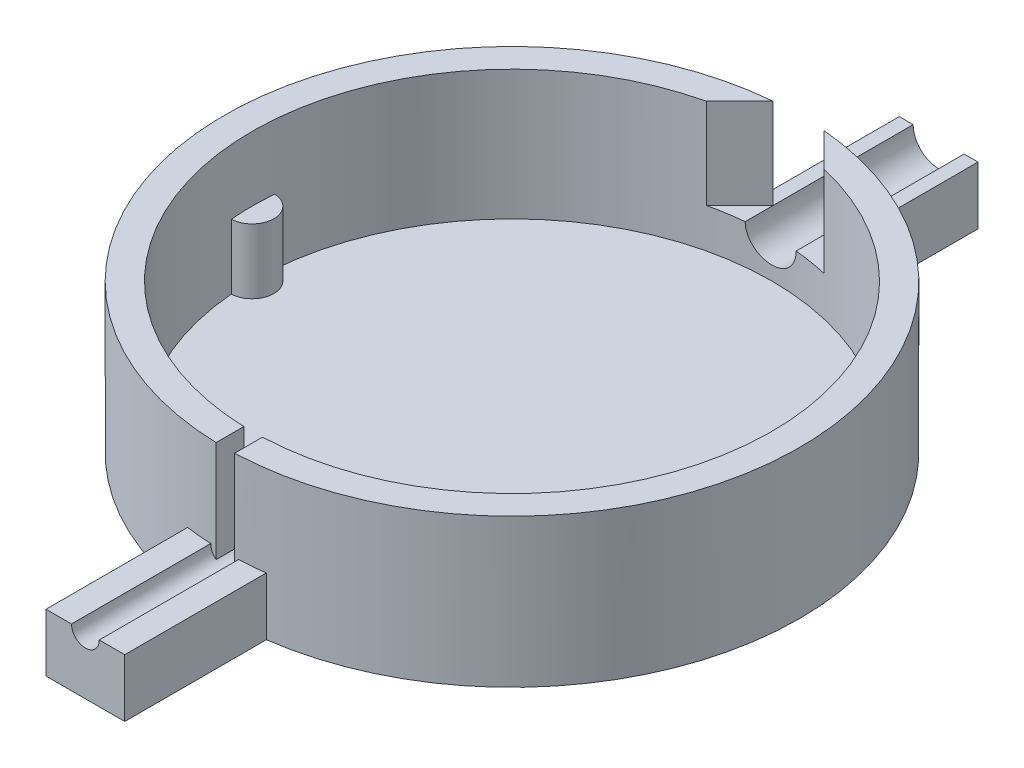
ISO-10303-21;
HEADER;
FILE_DESCRIPTION(('STEP AP214'),'2;1');
FILE_NAME('part.step','',(''),(''),'','','');
FILE_SCHEMA(('AUTOMOTIVE_DESIGN { 1 0 10303 214 1 1 1 1 }'));
ENDSEC;
DATA;
#1=APPLICATION_CONTEXT('core data for automotive mechanical design processes');
#2=APPLICATION_PROTOCOL_DEFINITION('international standard','automotive_design',2000,#1);
#3=PRODUCT_CONTEXT('',#1,'mechanical');
#4=PRODUCT('Part','Part','',(#3));
#5=PRODUCT_RELATED_PRODUCT_CATEGORY('part','',(#4));
#6=PRODUCT_DEFINITION_FORMATION('','',#4);
#7=PRODUCT_DEFINITION_CONTEXT('part definition',#1,'design');
#8=PRODUCT_DEFINITION('design','',#6,#7);
#9=PRODUCT_DEFINITION_SHAPE('','',#8);
#10=(LENGTH_UNIT() NAMED_UNIT(*) SI_UNIT(.MILLI.,.METRE.));
#11=(NAMED_UNIT(*) PLANE_ANGLE_UNIT() SI_UNIT($,.RADIAN.));
#12=(NAMED_UNIT(*) SI_UNIT($,.STERADIAN.) SOLID_ANGLE_UNIT());
#13=UNCERTAINTY_MEASURE_WITH_UNIT(LENGTH_MEASURE(1.E-05),#10,'distance_accuracy_value','');
#14=(GEOMETRIC_REPRESENTATION_CONTEXT(3) GLOBAL_UNCERTAINTY_ASSIGNED_CONTEXT((#13)) GLOBAL_UNIT_ASSIGNED_CONTEXT((#10,
#11,#12)) REPRESENTATION_CONTEXT('',''));
#15=CARTESIAN_POINT('',(0.,0.,0.));
#16=DIRECTION('',(0.,0.,1.));
#17=DIRECTION('',(1.,0.,0.));
#18=AXIS2_PLACEMENT_3D('',#15,#16,#17);
#19=CARTESIAN_POINT('',(0.,16.,0.));
#20=DIRECTION('',(0.,-1.,0.));
#21=DIRECTION('',(0.,0.,-1.));
#22=AXIS2_PLACEMENT_3D('',#19,#20,#21);
#23=CYLINDRICAL_SURFACE('',#22,31.06);
#24=CARTESIAN_POINT('',(0.,6.24999999999999,0.));
#25=DIRECTION('',(0.,1.,0.));
#26=DIRECTION('',(-1.,0.,0.));
#27=AXIS2_PLACEMENT_3D('',#24,#25,#26);
#28=CIRCLE('',#27,31.06);
#29=CARTESIAN_POINT('',(1.5,6.24999999999999,31.0237586375346));
#30=VERTEX_POINT('',#29);
#31=CARTESIAN_POINT('',(4.25,6.25,30.7678582290025));
#32=VERTEX_POINT('',#31);
#33=EDGE_CURVE('E12',#30,#32,#28,.T.);
#34=ORIENTED_EDGE('',*,*,#33,.T.);
#35=DIRECTION('',(0.,-1.,0.));
#36=VECTOR('',#35,1.);
#37=CARTESIAN_POINT('',(4.25,16.,30.7678582290025));
#38=LINE('',#37,#36);
#39=CARTESIAN_POINT('',(4.25,0.,30.7678582290025));
#40=VERTEX_POINT('',#39);
#41=EDGE_CURVE('E635',#32,#40,#38,.T.);
#42=ORIENTED_EDGE('',*,*,#41,.T.);
#43=CARTESIAN_POINT('',(0.,0.,0.));
#44=DIRECTION('',(0.,1.,0.));
#45=DIRECTION('',(0.,0.,1.));
#46=AXIS2_PLACEMENT_3D('',#43,#44,#45);
#47=CIRCLE('',#46,31.06);
#48=CARTESIAN_POINT('',(4.25,0.,-30.7678582290025));
#49=VERTEX_POINT('',#48);
#50=EDGE_CURVE('E268',#40,#49,#47,.T.);
#51=ORIENTED_EDGE('',*,*,#50,.T.);
#52=DIRECTION('',(0.,-1.,0.));
#53=VECTOR('',#52,1.);
#54=CARTESIAN_POINT('',(4.25,16.,-30.7678582290025));
#55=LINE('',#54,#53);
#56=CARTESIAN_POINT('',(4.25,6.25,-30.7678582290025));
#57=VERTEX_POINT('',#56);
#58=EDGE_CURVE('E634',#57,#49,#55,.T.);
#59=ORIENTED_EDGE('',*,*,#58,.F.);
#60=CARTESIAN_POINT('',(0.,6.25,0.));
#61=DIRECTION('',(0.,-1.,0.));
#62=DIRECTION('',(0.,0.,-1.));
#63=AXIS2_PLACEMENT_3D('',#60,#61,#62);
#64=CIRCLE('',#63,31.06);
#65=CARTESIAN_POINT('',(2.75,6.25,-30.9380202986552));
#66=VERTEX_POINT('',#65);
#67=EDGE_CURVE('E661',#66,#57,#64,.T.);
#68=ORIENTED_EDGE('',*,*,#67,.F.);
#69=DIRECTION('',(0.,-1.,0.));
#70=VECTOR('',#69,1.);
#71=CARTESIAN_POINT('',(2.75,16.,-30.9380202986552));
#72=LINE('',#71,#70);
#73=CARTESIAN_POINT('',(2.75,16.,-30.9380202986552));
#74=VERTEX_POINT('',#73);
#75=EDGE_CURVE('E688',#66,#74,#72,.F.);
#76=ORIENTED_EDGE('',*,*,#75,.T.);
#77=CARTESIAN_POINT('',(0.,16.,0.));
#78=DIRECTION('',(0.,1.,0.));
#79=DIRECTION('',(0.,0.,1.));
#80=AXIS2_PLACEMENT_3D('',#77,#78,#79);
#81=CIRCLE('',#80,31.06);
#82=CARTESIAN_POINT('',(1.09817667694527,16.,31.0405800201319));
#83=VERTEX_POINT('',#82);
#84=EDGE_CURVE('E264',#83,#74,#81,.T.);
#85=ORIENTED_EDGE('',*,*,#84,.F.);
#86=DIRECTION('',(0.,-1.,0.));
#87=VECTOR('',#86,1.);
#88=CARTESIAN_POINT('',(1.09817667694527,16.,31.0405800201319));
#89=LINE('',#88,#87);
#90=CARTESIAN_POINT('',(1.09817667694527,5.22823290999688,31.0405800201319));
#91=VERTEX_POINT('',#90);
#92=EDGE_CURVE('E675',#91,#83,#89,.F.);
#93=ORIENTED_EDGE('',*,*,#92,.F.);
#94=CARTESIAN_POINT('',(-1.5,6.25,31.0237586375346));
#95=CARTESIAN_POINT('',(-1.49999628253548,6.16579706835824,31.0237591246036));
#96=CARTESIAN_POINT('',(-1.49288605437479,6.08153433225865,31.0241051301728));
#97=CARTESIAN_POINT('',(-1.46462263785561,5.9153331174347,31.02545201881));
#98=CARTESIAN_POINT('',(-1.44345287943984,5.83339750032809,31.0264536745838));
#99=CARTESIAN_POINT('',(-1.3876777061799,5.67428218235709,31.0289981375779));
#100=CARTESIAN_POINT('',(-1.35307911151705,5.5971000903109,31.0305406700616));
#101=CARTESIAN_POINT('',(-1.2714387925071,5.44966015958785,31.0339927268488));
#102=CARTESIAN_POINT('',(-1.22440001582512,5.37940068602243,31.035902164186));
#103=CARTESIAN_POINT('',(-1.11916447798945,5.24771237996455,31.0398749590322));
#104=CARTESIAN_POINT('',(-1.06095845008783,5.18629095601391,31.041938443497));
#105=CARTESIAN_POINT('',(-0.93505906102969,5.07408539360754,31.0459856166731));
#106=CARTESIAN_POINT('',(-0.867365313799572,5.02330168823097,31.0479693021329));
#107=CARTESIAN_POINT('',(-0.724373962363878,4.93379326474336,31.0516342881519));
#108=CARTESIAN_POINT('',(-0.649072793394885,4.89507423505444,31.0533154459137));
#109=CARTESIAN_POINT('',(-0.493029238728981,4.83083078671933,31.0561846563226));
#110=CARTESIAN_POINT('',(-0.41228689218267,4.80530627314685,31.0573727125173));
#111=CARTESIAN_POINT('',(-0.247720372342416,4.76819574885948,31.0591209942328));
#112=CARTESIAN_POINT('',(-0.163898676753742,4.75659877439777,31.059681713569));
#113=CARTESIAN_POINT('',(0.00450342849488222,4.7476386924842,31.060113787985));
#114=CARTESIAN_POINT('',(0.0890838324877637,4.75027547880343,31.0599851482096));
#115=CARTESIAN_POINT('',(0.256528189226611,4.76969896169926,31.0590534175294));
#116=CARTESIAN_POINT('',(0.339393514648193,4.7864738555453,31.0582508892001));
#117=CARTESIAN_POINT('',(0.501130667756705,4.83367908275277,31.0560624298705));
#118=CARTESIAN_POINT('',(0.580002479526489,4.86410947053681,31.0546764965451));
#119=CARTESIAN_POINT('',(0.731551734577866,4.9377753457186,31.0514763834246));
#120=CARTESIAN_POINT('',(0.804226558302682,4.98101621407365,31.049662023737));
#121=CARTESIAN_POINT('',(0.941290227909294,5.07907166680123,31.0458093985227));
#122=CARTESIAN_POINT('',(1.00567901941786,5.13388632711516,31.043771131527));
#123=CARTESIAN_POINT('',(1.1244116940248,5.25360010848361,31.0396977919606));
#124=CARTESIAN_POINT('',(1.17874525353549,5.31850946923386,31.0376627247768));
#125=CARTESIAN_POINT('',(1.27574561130099,5.45653412713319,31.0338273056835));
#126=CARTESIAN_POINT('',(1.3184124066081,5.52964942635554,31.0320269538334));
#127=CARTESIAN_POINT('',(1.39086715899001,5.682016674597,31.028864147051));
#128=CARTESIAN_POINT('',(1.42065473345243,5.76126880584497,31.0275017051285));
#129=CARTESIAN_POINT('',(1.46649861565871,5.92365724737603,31.0253688614221));
#130=CARTESIAN_POINT('',(1.48255501975211,6.0067935304003,31.0245984554841));
#131=CARTESIAN_POINT('',(1.50046802134913,6.17450042407819,31.023737328264));
#132=CARTESIAN_POINT('',(1.50233894487766,6.25906950118578,31.0236459212577));
#133=CARTESIAN_POINT('',(1.49186525672249,6.42732041034442,31.0241513096711));
#134=CARTESIAN_POINT('',(1.47952068884123,6.51100224512855,31.0247481029702));
#135=CARTESIAN_POINT('',(1.44097831477044,6.67506303705206,31.0265620006345));
#136=CARTESIAN_POINT('',(1.41478706091875,6.75544353703166,31.0277788115935));
#137=CARTESIAN_POINT('',(1.34930142025187,6.91066746465768,31.0306953468753));
#138=CARTESIAN_POINT('',(1.31000696276811,6.98551086243858,31.0323950738025));
#139=CARTESIAN_POINT('',(1.21939355503307,7.12760197463153,31.0360875321815));
#140=CARTESIAN_POINT('',(1.16806497884623,7.19484354428501,31.0380804977133));
#141=CARTESIAN_POINT('',(1.05485443373915,7.31976045778387,31.0421339775183));
#142=CARTESIAN_POINT('',(0.992972401611297,7.37743574433003,31.0441944921961));
#143=CARTESIAN_POINT('',(0.860350034018404,7.4816310106187,31.0481528296657));
#144=CARTESIAN_POINT('',(0.789602425183501,7.52814173848515,31.0500505166942));
#145=CARTESIAN_POINT('',(0.641293961700206,7.60862437363092,31.0534673831195));
#146=CARTESIAN_POINT('',(0.56373313521879,7.64259633274458,31.054986564081));
#147=CARTESIAN_POINT('',(0.404034369094482,7.69702090537026,31.0574745533425));
#148=CARTESIAN_POINT('',(0.321898453062029,7.71747944532461,31.0584436028819));
#149=CARTESIAN_POINT('',(0.155352682968681,7.74431584691933,31.0597230744556));
#150=CARTESIAN_POINT('',(0.0709428406028013,7.75069378096358,31.0600334998767));
#151=CARTESIAN_POINT('',(-0.0976628256244342,7.74918722494995,31.0599607535772));
#152=CARTESIAN_POINT('',(-0.181858779894599,7.74131725213697,31.0595782878456));
#153=CARTESIAN_POINT('',(-0.347732607867237,7.71156827934042,31.0581642094661));
#154=CARTESIAN_POINT('',(-0.429410476795021,7.68968925279518,31.0571325955875));
#155=CARTESIAN_POINT('',(-0.587932775453904,7.63254615678811,31.0545362976825));
#156=CARTESIAN_POINT('',(-0.664777163215968,7.59728197112186,31.0529716090282));
#157=CARTESIAN_POINT('',(-0.811455366341196,7.51437220175139,31.0494851662233));
#158=CARTESIAN_POINT('',(-0.881289400814072,7.46672700518478,31.0475634232379));
#159=CARTESIAN_POINT('',(-1.01203684243223,7.36035609241556,31.0435769734019));
#160=CARTESIAN_POINT('',(-1.07294207726776,7.30162033639354,31.0415121380963));
#161=CARTESIAN_POINT('',(-1.18404642740276,7.17474068570253,31.0374730573387));
#162=CARTESIAN_POINT('',(-1.23424290316817,7.1065944783138,31.035498834315));
#163=CARTESIAN_POINT('',(-1.32252680558032,6.96277758346096,31.0318623845276));
#164=CARTESIAN_POINT('',(-1.36060296719426,6.88709998129858,31.0302004485983));
#165=CARTESIAN_POINT('',(-1.42346354754071,6.730474924342,31.0273806650542));
#166=CARTESIAN_POINT('',(-1.44826368198635,6.6495338282137,31.0262222217288));
#167=CARTESIAN_POINT('',(-1.47735601277738,6.51507411884053,31.0248470942022));
#168=CARTESIAN_POINT('',(-1.48583668326934,6.46242663038416,31.0244407202596));
#169=CARTESIAN_POINT('',(-1.49715985066805,6.35652740786829,31.0238963379468));
#170=CARTESIAN_POINT('',(-1.50000235206097,6.30327567428962,31.0237583293632));
#171=CARTESIAN_POINT('',(-1.5,6.25,31.0237586375346));
#172=B_SPLINE_CURVE_WITH_KNOTS('',3,(#94,#95,#96,#97,#98,#99,#100,#101,#102,#103,#104,#105,#106,
#107,#108,#109,#110,#111,#112,#113,#114,#115,#116,#117,#118,#119,#120,#121,#122,#123,#124,#125,
#126,#127,#128,#129,#130,#131,#132,#133,#134,#135,#136,#137,#138,#139,#140,#141,#142,#143,#144,
#145,#146,#147,#148,#149,#150,#151,#152,#153,#154,#155,#156,#157,#158,#159,#160,#161,#162,#163,
#164,#165,#166,#167,#168,#169,#170,#171),.UNSPECIFIED.,.T.,.F.,(4,2,2,2,2,2,2,2,2,2,2,2,2,2,2,2,
2,2,2,2,2,2,2,2,2,2,2,2,2,2,2,2,2,2,2,2,2,2,4),(0.,0.252414319633615,0.505126654888165,
0.757710811245564,1.01023517205619,1.26296999475339,1.51571510470526,1.76857920276602,
2.02144148160213,2.27410457672111,2.52676578617607,2.7792162784785,3.03166777690622,
3.2842254666208,3.53678481354336,3.78960203881468,4.04241932796225,4.2952441272208,
4.54806715243147,4.80063481569018,5.0532017007096,5.30564917634525,5.55809801350976,
5.81074947433891,6.06340244842174,6.31626407438614,6.56912465502764,6.8218742674255,
7.07462258015666,7.32711351161956,7.57960492181594,7.83209852408844,8.08458423217436,
8.33729961042472,8.59007720709993,8.8430890625022,9.09580074495926,9.255504849277,
9.41520882652154),.UNSPECIFIED.);
#173=EDGE_CURVE('E317',#91,#30,#172,.T.);
#174=ORIENTED_EDGE('',*,*,#173,.T.);
#175=EDGE_LOOP('',(#34,#42,#51,#59,#68,#76,#85,#93,#174));
#176=FACE_BOUND('',#175,.T.);
#177=ADVANCED_FACE('F50',(#176),#23,.T.);
#178=CARTESIAN_POINT('',(1.09817667694527,3.99903604108872,31.06));
#179=DIRECTION('',(0.,-1.,0.));
#180=DIRECTION('',(0.,0.,-1.));
#181=AXIS2_PLACEMENT_3D('',#178,#179,#180);
#182=PLANE('',#181);
#183=DIRECTION('',(0.,0.,-1.));
#184=VECTOR('',#183,1.);
#185=CARTESIAN_POINT('',(-0.901823323054726,3.99903604108872,31.06));
#186=LINE('',#185,#184);
#187=CARTESIAN_POINT('',(-0.901823323054726,3.99903604108872,28.06));
#188=VERTEX_POINT('',#187);
#189=CARTESIAN_POINT('',(-0.901823323054726,3.99903604108872,28.0455043579893));
#190=VERTEX_POINT('',#189);
#191=EDGE_CURVE('E644',#188,#190,#186,.T.);
#192=ORIENTED_EDGE('',*,*,#191,.F.);
#193=DIRECTION('',(1.,0.,0.));
#194=VECTOR('',#193,1.);
#195=CARTESIAN_POINT('',(1.09817667694527,3.99903604108872,28.06));
#196=LINE('',#195,#194);
#197=CARTESIAN_POINT('',(0.,3.99903604108872,28.06));
#198=VERTEX_POINT('',#197);
#199=EDGE_CURVE('E66',#188,#198,#196,.T.);
#200=ORIENTED_EDGE('',*,*,#199,.T.);
#201=CARTESIAN_POINT('',(0.,3.99903604108872,0.));
#202=DIRECTION('',(0.,-1.,0.));
#203=DIRECTION('',(0.,0.,-1.));
#204=AXIS2_PLACEMENT_3D('',#201,#202,#203);
#205=CIRCLE('',#204,28.06);
#206=EDGE_CURVE('E681',#190,#198,#205,.F.);
#207=ORIENTED_EDGE('',*,*,#206,.F.);
#208=EDGE_LOOP('',(#192,#200,#207));
#209=FACE_BOUND('',#208,.T.);
#210=ADVANCED_FACE('F365',(#209),#182,.F.);
#211=CARTESIAN_POINT('',(-4.25,0.,-30.7678582290025));
#212=VERTEX_POINT('',#211);
#213=CARTESIAN_POINT('',(-4.25,0.,30.7678582290025));
#214=VERTEX_POINT('',#213);
#215=EDGE_CURVE('E265',#212,#214,#47,.T.);
#216=ORIENTED_EDGE('',*,*,#215,.T.);
#217=DIRECTION('',(0.,-1.,0.));
#218=VECTOR('',#217,1.);
#219=CARTESIAN_POINT('',(-4.25,16.,30.7678582290025));
#220=LINE('',#219,#218);
#221=CARTESIAN_POINT('',(-4.25,6.25,30.7678582290025));
#222=VERTEX_POINT('',#221);
#223=EDGE_CURVE('E283',#214,#222,#220,.F.);
#224=ORIENTED_EDGE('',*,*,#223,.T.);
#225=CARTESIAN_POINT('',(0.,6.24999999999999,0.));
#226=DIRECTION('',(0.,1.,0.));
#227=DIRECTION('',(-1.,0.,0.));
#228=AXIS2_PLACEMENT_3D('',#225,#226,#227);
#229=CIRCLE('',#228,31.06);
#230=CARTESIAN_POINT('',(-1.5,6.24999999999999,31.0237586375346));
#231=VERTEX_POINT('',#230);
#232=EDGE_CURVE('E59',#222,#231,#229,.T.);
#233=ORIENTED_EDGE('',*,*,#232,.T.);
#234=CARTESIAN_POINT('',(-0.901823323054726,5.05136965915486,31.0469050743225));
#235=VERTEX_POINT('',#234);
#236=EDGE_CURVE('E281',#231,#235,#172,.T.);
#237=ORIENTED_EDGE('',*,*,#236,.T.);
#238=DIRECTION('',(0.,-1.,0.));
#239=VECTOR('',#238,1.);
#240=CARTESIAN_POINT('',(-0.901823323054724,16.,31.0469050743225));
#241=LINE('',#240,#239);
#242=CARTESIAN_POINT('',(-0.901823323054725,16.,31.0469050743225));
#243=VERTEX_POINT('',#242);
#244=EDGE_CURVE('E670',#235,#243,#241,.F.);
#245=ORIENTED_EDGE('',*,*,#244,.T.);
#246=CARTESIAN_POINT('',(-2.75,16.,-30.9380202986552));
#247=VERTEX_POINT('',#246);
#248=EDGE_CURVE('E262',#247,#243,#81,.T.);
#249=ORIENTED_EDGE('',*,*,#248,.F.);
#250=DIRECTION('',(0.,-1.,0.));
#251=VECTOR('',#250,1.);
#252=CARTESIAN_POINT('',(-2.75,16.,-30.9380202986552));
#253=LINE('',#252,#251);
#254=CARTESIAN_POINT('',(-2.75,6.25,-30.9380202986552));
#255=VERTEX_POINT('',#254);
#256=EDGE_CURVE('E233',#255,#247,#253,.F.);
#257=ORIENTED_EDGE('',*,*,#256,.F.);
#258=CARTESIAN_POINT('',(0.,6.25,0.));
#259=DIRECTION('',(0.,-1.,0.));
#260=DIRECTION('',(0.,0.,-1.));
#261=AXIS2_PLACEMENT_3D('',#258,#259,#260);
#262=CIRCLE('',#261,31.06);
#263=CARTESIAN_POINT('',(-4.25,6.25,-30.7678582290025));
#264=VERTEX_POINT('',#263);
#265=EDGE_CURVE('E663',#264,#255,#262,.T.);
#266=ORIENTED_EDGE('',*,*,#265,.F.);
#267=DIRECTION('',(0.,-1.,0.));
#268=VECTOR('',#267,1.);
#269=CARTESIAN_POINT('',(-4.25,16.,-30.7678582290025));
#270=LINE('',#269,#268);
#271=EDGE_CURVE('E645',#264,#212,#270,.T.);
#272=ORIENTED_EDGE('',*,*,#271,.T.);
#273=EDGE_LOOP('',(#216,#224,#233,#237,#245,#249,#257,#266,#272));
#274=FACE_BOUND('',#273,.T.);
#275=ADVANCED_FACE('F52',(#274),#23,.T.);
#276=CARTESIAN_POINT('',(0.,2.,0.));
#277=DIRECTION('',(0.,1.,0.));
#278=DIRECTION('',(0.,0.,1.));
#279=AXIS2_PLACEMENT_3D('',#276,#277,#278);
#280=CYLINDRICAL_SURFACE('',#279,28.06);
#281=DIRECTION('',(0.,-1.,0.));
#282=VECTOR('',#281,1.);
#283=CARTESIAN_POINT('',(27.9615947968639,9.,2.34793875899601));
#284=LINE('',#283,#282);
#285=CARTESIAN_POINT('',(27.9615947968639,9.,2.34793875899601));
#286=VERTEX_POINT('',#285);
#287=CARTESIAN_POINT('',(27.9615947968639,2.,2.34793875899601));
#288=VERTEX_POINT('',#287);
#289=EDGE_CURVE('E613',#286,#288,#284,.T.);
#290=ORIENTED_EDGE('',*,*,#289,.T.);
#291=CARTESIAN_POINT('',(0.,2.,0.));
#292=DIRECTION('',(0.,1.,0.));
#293=DIRECTION('',(0.,0.,1.));
#294=AXIS2_PLACEMENT_3D('',#291,#292,#293);
#295=CIRCLE('',#294,28.06);
#296=CARTESIAN_POINT('',(-27.9615947968639,2.,2.34793875899603));
#297=VERTEX_POINT('',#296);
#298=EDGE_CURVE('E253',#297,#288,#295,.T.);
#299=ORIENTED_EDGE('',*,*,#298,.F.);
#300=DIRECTION('',(0.,-1.,0.));
#301=VECTOR('',#300,1.);
#302=CARTESIAN_POINT('',(-27.9615947968639,9.,2.34793875899601));
#303=LINE('',#302,#301);
#304=CARTESIAN_POINT('',(-27.9615947968639,9.,2.34793875899601));
#305=VERTEX_POINT('',#304);
#306=EDGE_CURVE('E617',#305,#297,#303,.T.);
#307=ORIENTED_EDGE('',*,*,#306,.F.);
#308=CARTESIAN_POINT('',(0.,9.,0.));
#309=DIRECTION('',(0.,1.,0.));
#310=DIRECTION('',(0.,0.,1.));
#311=AXIS2_PLACEMENT_3D('',#308,#309,#310);
#312=CIRCLE('',#311,28.06);
#313=CARTESIAN_POINT('',(-27.9615947968639,9.,-2.34793875899601));
#314=VERTEX_POINT('',#313);
#315=EDGE_CURVE('E382',#314,#305,#312,.T.);
#316=ORIENTED_EDGE('',*,*,#315,.F.);
#317=DIRECTION('',(0.,-1.,0.));
#318=VECTOR('',#317,1.);
#319=CARTESIAN_POINT('',(-27.9615947968639,9.,-2.34793875899601));
#320=LINE('',#319,#318);
#321=CARTESIAN_POINT('',(-27.9615947968639,2.,-2.34793875899601));
#322=VERTEX_POINT('',#321);
#323=EDGE_CURVE('E620',#314,#322,#320,.T.);
#324=ORIENTED_EDGE('',*,*,#323,.T.);
#325=CARTESIAN_POINT('',(27.9615947968639,2.,-2.34793875899603));
#326=VERTEX_POINT('',#325);
#327=EDGE_CURVE('E256',#326,#322,#295,.T.);
#328=ORIENTED_EDGE('',*,*,#327,.F.);
#329=DIRECTION('',(0.,-1.,0.));
#330=VECTOR('',#329,1.);
#331=CARTESIAN_POINT('',(27.9615947968639,9.,-2.34793875899601));
#332=LINE('',#331,#330);
#333=CARTESIAN_POINT('',(27.9615947968639,9.,-2.34793875899601));
#334=VERTEX_POINT('',#333);
#335=EDGE_CURVE('E259',#334,#326,#332,.T.);
#336=ORIENTED_EDGE('',*,*,#335,.F.);
#337=CARTESIAN_POINT('',(0.,9.,0.));
#338=DIRECTION('',(0.,1.,0.));
#339=DIRECTION('',(0.,0.,1.));
#340=AXIS2_PLACEMENT_3D('',#337,#338,#339);
#341=CIRCLE('',#340,28.06);
#342=EDGE_CURVE('E602',#286,#334,#341,.T.);
#343=ORIENTED_EDGE('',*,*,#342,.F.);
#344=EDGE_LOOP('',(#290,#299,#307,#316,#324,#328,#336,#343));
#345=FACE_BOUND('',#344,.T.);
#346=CARTESIAN_POINT('',(2.75,6.25,-27.9249189792916));
#347=CARTESIAN_POINT('',(2.75000762604001,6.17285122451434,-27.9249158378654));
#348=CARTESIAN_POINT('',(2.7467535335797,6.09570621570774,-27.9252386238796));
#349=CARTESIAN_POINT('',(2.73378096262099,5.94197177815165,-27.9265128405603));
#350=CARTESIAN_POINT('',(2.72406290892857,5.86538231322664,-27.9274642299156));
#351=CARTESIAN_POINT('',(2.69823307845418,5.71336515347341,-27.9299713202481));
#352=CARTESIAN_POINT('',(2.68212706278554,5.6379364752667,-27.9315264766792));
#353=CARTESIAN_POINT('',(2.64365482874337,5.48872917224581,-27.9351939143197));
#354=CARTESIAN_POINT('',(2.62128866269969,5.4149505336442,-27.9373061908721));
#355=CARTESIAN_POINT('',(2.54499107335327,5.19681442433682,-27.9443960732037));
#356=CARTESIAN_POINT('',(2.48184728510449,5.05557910003723,-27.9501281020915));
#357=CARTESIAN_POINT('',(2.33289779170415,4.78580662995251,-27.9629529242207));
#358=CARTESIAN_POINT('',(2.24709488486782,4.65726791887523,-27.970045549404));
#359=CARTESIAN_POINT('',(2.05492547253204,4.41598129250948,-27.984820376452));
#360=CARTESIAN_POINT('',(1.94849769689923,4.30328219694001,-27.9925042928038));
#361=CARTESIAN_POINT('',(1.71822353140403,4.09730864609516,-28.0075810234377));
#362=CARTESIAN_POINT('',(1.59437449401103,4.00403714861041,-28.014973793255));
#363=CARTESIAN_POINT('',(1.33247593839494,3.83940332430185,-28.0286515936653));
#364=CARTESIAN_POINT('',(1.1943986609925,3.76808495093866,-28.0349343913546));
#365=CARTESIAN_POINT('',(0.908165203649419,3.64966897125742,-28.0456649742544));
#366=CARTESIAN_POINT('',(0.760009868899055,3.60256933667788,-28.0501129131237));
#367=CARTESIAN_POINT('',(0.458323420127776,3.5340675163525,-28.0566608696201));
#368=CARTESIAN_POINT('',(0.304811119953756,3.51258320275075,-28.0587683896008));
#369=CARTESIAN_POINT('',(-0.00365765304470374,3.49566784182806,-28.0604235734834));
#370=CARTESIAN_POINT('',(-0.158614125090158,3.50023678045485,-28.059971238766));
#371=CARTESIAN_POINT('',(-0.465006713855914,3.53523237745347,-28.056563733279));
#372=CARTESIAN_POINT('',(-0.616453112285158,3.56556997444753,-28.0536171831118));
#373=CARTESIAN_POINT('',(-0.912093414019403,3.65110289987346,-28.0455623609739));
#374=CARTESIAN_POINT('',(-1.05628726238038,3.70629841659296,-28.0404540726292));
#375=CARTESIAN_POINT('',(-1.33361389810405,3.84007942227885,-28.0286352063607));
#376=CARTESIAN_POINT('',(-1.46672729690811,3.9187048521293,-28.0219218962573));
#377=CARTESIAN_POINT('',(-1.71789614009217,4.09708132998642,-28.0076468472272));
#378=CARTESIAN_POINT('',(-1.83595183446882,4.1968320271861,-28.0000851223901));
#379=CARTESIAN_POINT('',(-2.05416699955354,4.41511243530962,-27.9849251560553));
#380=CARTESIAN_POINT('',(-2.15425160628163,4.53371699188422,-27.977326891288));
#381=CARTESIAN_POINT('',(-2.33313301231189,4.78612903656824,-27.9629786075503));
#382=CARTESIAN_POINT('',(-2.41192332594767,4.91994113889739,-27.9562288473456));
#383=CARTESIAN_POINT('',(-2.54597642087879,5.19904434136322,-27.944340292271));
#384=CARTESIAN_POINT('',(-2.60122052001297,5.34434444842248,-27.9392027774463));
#385=CARTESIAN_POINT('',(-2.68642396132026,5.64211135878502,-27.9311401223453));
#386=CARTESIAN_POINT('',(-2.71642156511995,5.79456694620583,-27.9282116349399));
#387=CARTESIAN_POINT('',(-2.7389341742198,5.99840634304455,-27.9260067117938));
#388=CARTESIAN_POINT('',(-2.74308592390789,6.04867915320838,-27.9255990682959));
#389=CARTESIAN_POINT('',(-2.74861508907414,6.1492943298279,-27.9250555384502));
#390=CARTESIAN_POINT('',(-2.74999713200542,6.1996364394115,-27.9249191988275));
#391=CARTESIAN_POINT('',(-2.75,6.25,-27.9249189792916));
#392=B_SPLINE_CURVE_WITH_KNOTS('',3,(#346,#347,#348,#349,#350,#351,#352,#353,#354,#355,#356,
#357,#358,#359,#360,#361,#362,#363,#364,#365,#366,#367,#368,#369,#370,#371,#372,#373,#374,#375,
#376,#377,#378,#379,#380,#381,#382,#383,#384,#385,#386,#387,#388,#389,#390,#391),.UNSPECIFIED.,
.F.,.F.,(4,2,2,2,2,2,2,2,2,2,2,2,2,2,2,2,2,2,2,2,2,2,4),(0.,0.231370315810173,0.462725427664361,
0.693872359940492,0.925017360070965,1.38707394262178,1.84907348959957,2.3124671371764,
2.77593128349219,3.24031740824462,3.70466463543233,4.1675190340032,4.63037318292565,
5.09163409889569,5.55289850876953,6.01495377684137,6.47700137260765,6.94093123605871,
7.40500224118094,7.86944076960834,8.3331741570921,8.48445578532866,8.63548445024749),.UNSPECIFIED.);
#393=CARTESIAN_POINT('',(2.75,6.25,-27.9249189792916));
#394=VERTEX_POINT('',#393);
#395=CARTESIAN_POINT('',(-2.75,6.25,-27.9249189792916));
#396=VERTEX_POINT('',#395);
#397=EDGE_CURVE('E373',#394,#396,#392,.T.);
#398=ORIENTED_EDGE('',*,*,#397,.T.);
#399=CARTESIAN_POINT('',(0.,6.25,0.));
#400=DIRECTION('',(0.,-1.,0.));
#401=DIRECTION('',(0.,0.,-1.));
#402=AXIS2_PLACEMENT_3D('',#399,#400,#401);
#403=CIRCLE('',#402,28.06);
#404=CARTESIAN_POINT('',(-6.35777526308981,6.25,-27.3302450355653));
#405=VERTEX_POINT('',#404);
#406=EDGE_CURVE('E247',#405,#396,#403,.T.);
#407=ORIENTED_EDGE('',*,*,#406,.F.);
#408=DIRECTION('',(0.,1.,0.));
#409=VECTOR('',#408,1.);
#410=CARTESIAN_POINT('',(-6.35777526308981,1.14783529294419,-27.3302450355653));
#411=LINE('',#410,#409);
#412=CARTESIAN_POINT('',(-6.35777526308981,16.,-27.3302450355653));
#413=VERTEX_POINT('',#412);
#414=EDGE_CURVE('E230',#405,#413,#411,.T.);
#415=ORIENTED_EDGE('',*,*,#414,.T.);
#416=CARTESIAN_POINT('',(0.,16.,0.));
#417=DIRECTION('',(0.,1.,0.));
#418=DIRECTION('',(0.,0.,1.));
#419=AXIS2_PLACEMENT_3D('',#416,#417,#418);
#420=CIRCLE('',#419,28.06);
#421=CARTESIAN_POINT('',(-0.901823323054725,16.,28.0455043579893));
#422=VERTEX_POINT('',#421);
#423=EDGE_CURVE('E245',#413,#422,#420,.T.);
#424=ORIENTED_EDGE('',*,*,#423,.T.);
#425=DIRECTION('',(0.,1.,0.));
#426=VECTOR('',#425,1.);
#427=CARTESIAN_POINT('',(-0.901823323054726,2.,28.0455043579893));
#428=LINE('',#427,#426);
#429=EDGE_CURVE('E673',#422,#190,#428,.F.);
#430=ORIENTED_EDGE('',*,*,#429,.T.);
#431=ORIENTED_EDGE('',*,*,#206,.T.);
#432=CARTESIAN_POINT('',(1.09817667694527,3.99903604108872,28.0385022422064));
#433=VERTEX_POINT('',#432);
#434=EDGE_CURVE('E680',#198,#433,#205,.F.);
#435=ORIENTED_EDGE('',*,*,#434,.T.);
#436=DIRECTION('',(0.,1.,0.));
#437=VECTOR('',#436,1.);
#438=CARTESIAN_POINT('',(1.09817667694527,2.,28.0385022422064));
#439=LINE('',#438,#437);
#440=CARTESIAN_POINT('',(1.09817667694527,16.,28.0385022422064));
#441=VERTEX_POINT('',#440);
#442=EDGE_CURVE('E677',#441,#433,#439,.F.);
#443=ORIENTED_EDGE('',*,*,#442,.F.);
#444=CARTESIAN_POINT('',(6.35777526308981,16.,-27.3302450355653));
#445=VERTEX_POINT('',#444);
#446=EDGE_CURVE('E254',#441,#445,#420,.T.);
#447=ORIENTED_EDGE('',*,*,#446,.T.);
#448=DIRECTION('',(0.,1.,0.));
#449=VECTOR('',#448,1.);
#450=CARTESIAN_POINT('',(6.35777526308981,1.14783529294419,-27.3302450355653));
#451=LINE('',#450,#449);
#452=CARTESIAN_POINT('',(6.35777526308981,6.25,-27.3302450355653));
#453=VERTEX_POINT('',#452);
#454=EDGE_CURVE('E712',#453,#445,#451,.T.);
#455=ORIENTED_EDGE('',*,*,#454,.F.);
#456=CARTESIAN_POINT('',(0.,6.25,0.));
#457=DIRECTION('',(0.,-1.,0.));
#458=DIRECTION('',(0.,0.,-1.));
#459=AXIS2_PLACEMENT_3D('',#456,#457,#458);
#460=CIRCLE('',#459,28.06);
#461=EDGE_CURVE('E703',#394,#453,#460,.T.);
#462=ORIENTED_EDGE('',*,*,#461,.F.);
#463=EDGE_LOOP('',(#398,#407,#415,#424,#430,#431,#435,#443,#447,#455,#462));
#464=FACE_BOUND('',#463,.T.);
#465=ADVANCED_FACE('F243',(#345,#464),#280,.F.);
#466=CARTESIAN_POINT('',(0.,16.,0.));
#467=DIRECTION('',(0.,1.,0.));
#468=DIRECTION('',(0.,0.,1.));
#469=AXIS2_PLACEMENT_3D('',#466,#467,#468);
#470=PLANE('',#469);
#471=DIRECTION('',(-0.707106781186544,0.,-0.707106781186551));
#472=VECTOR('',#471,1.);
#473=CARTESIAN_POINT('',(2.75,16.,-30.9380202986552));
#474=LINE('',#473,#472);
#475=EDGE_CURVE('E700',#445,#74,#474,.T.);
#476=ORIENTED_EDGE('',*,*,#475,.F.);
#477=ORIENTED_EDGE('',*,*,#446,.F.);
#478=DIRECTION('',(0.,0.,1.));
#479=VECTOR('',#478,1.);
#480=CARTESIAN_POINT('',(1.09817667694527,16.,0.));
#481=LINE('',#480,#479);
#482=EDGE_CURVE('E270',#441,#83,#481,.T.);
#483=ORIENTED_EDGE('',*,*,#482,.T.);
#484=ORIENTED_EDGE('',*,*,#84,.T.);
#485=EDGE_LOOP('',(#476,#477,#483,#484));
#486=FACE_BOUND('',#485,.T.);
#487=ADVANCED_FACE('F388',(#486),#470,.T.);
#488=DIRECTION('',(-0.707106781186543,0.,0.707106781186552));
#489=VECTOR('',#488,1.);
#490=CARTESIAN_POINT('',(-2.75,16.,-30.9380202986552));
#491=LINE('',#490,#489);
#492=EDGE_CURVE('E226',#247,#413,#491,.T.);
#493=ORIENTED_EDGE('',*,*,#492,.F.);
#494=ORIENTED_EDGE('',*,*,#248,.T.);
#495=DIRECTION('',(0.,0.,1.));
#496=VECTOR('',#495,1.);
#497=CARTESIAN_POINT('',(-0.901823323054725,16.,0.));
#498=LINE('',#497,#496);
#499=EDGE_CURVE('E252',#422,#243,#498,.T.);
#500=ORIENTED_EDGE('',*,*,#499,.F.);
#501=ORIENTED_EDGE('',*,*,#423,.F.);
#502=EDGE_LOOP('',(#493,#494,#500,#501));
#503=FACE_BOUND('',#502,.T.);
#504=ADVANCED_FACE('F250',(#503),#470,.T.);
#505=CARTESIAN_POINT('',(0.,2.,0.));
#506=DIRECTION('',(0.,1.,0.));
#507=DIRECTION('',(0.,0.,1.));
#508=AXIS2_PLACEMENT_3D('',#505,#506,#507);
#509=PLANE('',#508);
#510=ORIENTED_EDGE('',*,*,#327,.T.);
#511=CARTESIAN_POINT('',(-28.06,2.,0.));
#512=DIRECTION('',(0.,1.,0.));
#513=DIRECTION('',(0.,0.,1.));
#514=AXIS2_PLACEMENT_3D('',#511,#512,#513);
#515=CIRCLE('',#514,2.35);
#516=EDGE_CURVE('E380',#297,#322,#515,.T.);
#517=ORIENTED_EDGE('',*,*,#516,.F.);
#518=ORIENTED_EDGE('',*,*,#298,.T.);
#519=CARTESIAN_POINT('',(28.06,2.,0.));
#520=DIRECTION('',(0.,1.,0.));
#521=DIRECTION('',(0.,0.,1.));
#522=AXIS2_PLACEMENT_3D('',#519,#520,#521);
#523=CIRCLE('',#522,2.35);
#524=EDGE_CURVE('E607',#326,#288,#523,.T.);
#525=ORIENTED_EDGE('',*,*,#524,.F.);
#526=EDGE_LOOP('',(#510,#517,#518,#525));
#527=FACE_BOUND('',#526,.T.);
#528=ADVANCED_FACE('F390',(#527),#509,.T.);
#529=CARTESIAN_POINT('',(0.,0.,0.));
#530=DIRECTION('',(0.,1.,0.));
#531=DIRECTION('',(0.,0.,1.));
#532=AXIS2_PLACEMENT_3D('',#529,#530,#531);
#533=PLANE('',#532);
#534=ORIENTED_EDGE('',*,*,#50,.F.);
#535=DIRECTION('',(0.,0.,-1.));
#536=VECTOR('',#535,1.);
#537=CARTESIAN_POINT('',(4.25,0.,46.06));
#538=LINE('',#537,#536);
#539=CARTESIAN_POINT('',(4.25,0.,46.06));
#540=VERTEX_POINT('',#539);
#541=EDGE_CURVE('E732',#540,#40,#538,.T.);
#542=ORIENTED_EDGE('',*,*,#541,.F.);
#543=DIRECTION('',(-1.,0.,0.));
#544=VECTOR('',#543,1.);
#545=CARTESIAN_POINT('',(4.25,0.,46.06));
#546=LINE('',#545,#544);
#547=CARTESIAN_POINT('',(-4.25,0.,46.06));
#548=VERTEX_POINT('',#547);
#549=EDGE_CURVE('E298',#540,#548,#546,.T.);
#550=ORIENTED_EDGE('',*,*,#549,.T.);
#551=DIRECTION('',(0.,0.,-1.));
#552=VECTOR('',#551,1.);
#553=CARTESIAN_POINT('',(-4.25,0.,46.06));
#554=LINE('',#553,#552);
#555=EDGE_CURVE('E309',#548,#214,#554,.T.);
#556=ORIENTED_EDGE('',*,*,#555,.T.);
#557=ORIENTED_EDGE('',*,*,#215,.F.);
#558=DIRECTION('',(0.,0.,1.));
#559=VECTOR('',#558,1.);
#560=CARTESIAN_POINT('',(-4.25,0.,-46.06));
#561=LINE('',#560,#559);
#562=CARTESIAN_POINT('',(-4.25,0.,-46.06));
#563=VERTEX_POINT('',#562);
#564=EDGE_CURVE('E74',#563,#212,#561,.T.);
#565=ORIENTED_EDGE('',*,*,#564,.F.);
#566=DIRECTION('',(1.,0.,0.));
#567=VECTOR('',#566,1.);
#568=CARTESIAN_POINT('',(-4.25,0.,-46.06));
#569=LINE('',#568,#567);
#570=CARTESIAN_POINT('',(4.25,0.,-46.06));
#571=VERTEX_POINT('',#570);
#572=EDGE_CURVE('E648',#563,#571,#569,.T.);
#573=ORIENTED_EDGE('',*,*,#572,.T.);
#574=DIRECTION('',(0.,0.,1.));
#575=VECTOR('',#574,1.);
#576=CARTESIAN_POINT('',(4.25,0.,-46.06));
#577=LINE('',#576,#575);
#578=EDGE_CURVE('E640',#571,#49,#577,.T.);
#579=ORIENTED_EDGE('',*,*,#578,.T.);
#580=EDGE_LOOP('',(#534,#542,#550,#556,#557,#565,#573,#579));
#581=FACE_BOUND('',#580,.T.);
#582=ADVANCED_FACE('F393',(#581),#533,.F.);
#583=CARTESIAN_POINT('',(28.06,9.,0.));
#584=DIRECTION('',(0.,-1.,0.));
#585=DIRECTION('',(0.,0.,-1.));
#586=AXIS2_PLACEMENT_3D('',#583,#584,#585);
#587=CYLINDRICAL_SURFACE('',#586,2.35);
#588=ORIENTED_EDGE('',*,*,#524,.T.);
#589=ORIENTED_EDGE('',*,*,#289,.F.);
#590=CARTESIAN_POINT('',(28.06,9.,0.));
#591=DIRECTION('',(0.,1.,0.));
#592=DIRECTION('',(0.,0.,1.));
#593=AXIS2_PLACEMENT_3D('',#590,#591,#592);
#594=CIRCLE('',#593,2.35);
#595=EDGE_CURVE('E604',#334,#286,#594,.T.);
#596=ORIENTED_EDGE('',*,*,#595,.F.);
#597=ORIENTED_EDGE('',*,*,#335,.T.);
#598=EDGE_LOOP('',(#588,#589,#596,#597));
#599=FACE_BOUND('',#598,.T.);
#600=ADVANCED_FACE('F395',(#599),#587,.T.);
#601=CARTESIAN_POINT('',(14.03,9.,0.));
#602=DIRECTION('',(0.,1.,0.));
#603=DIRECTION('',(0.,0.,1.));
#604=AXIS2_PLACEMENT_3D('',#601,#602,#603);
#605=PLANE('',#604);
#606=ORIENTED_EDGE('',*,*,#342,.T.);
#607=ORIENTED_EDGE('',*,*,#595,.T.);
#608=EDGE_LOOP('',(#606,#607));
#609=FACE_BOUND('',#608,.T.);
#610=ADVANCED_FACE('F401',(#609),#605,.T.);
#611=CARTESIAN_POINT('',(-28.06,9.,0.));
#612=DIRECTION('',(0.,-1.,0.));
#613=DIRECTION('',(0.,0.,-1.));
#614=AXIS2_PLACEMENT_3D('',#611,#612,#613);
#615=CYLINDRICAL_SURFACE('',#614,2.35);
#616=ORIENTED_EDGE('',*,*,#516,.T.);
#617=ORIENTED_EDGE('',*,*,#323,.F.);
#618=CARTESIAN_POINT('',(-28.06,9.,0.));
#619=DIRECTION('',(0.,1.,0.));
#620=DIRECTION('',(0.,0.,1.));
#621=AXIS2_PLACEMENT_3D('',#618,#619,#620);
#622=CIRCLE('',#621,2.35);
#623=EDGE_CURVE('E622',#305,#314,#622,.T.);
#624=ORIENTED_EDGE('',*,*,#623,.F.);
#625=ORIENTED_EDGE('',*,*,#306,.T.);
#626=EDGE_LOOP('',(#616,#617,#624,#625));
#627=FACE_BOUND('',#626,.T.);
#628=ADVANCED_FACE('F571',(#627),#615,.T.);
#629=CARTESIAN_POINT('',(-14.03,9.,0.));
#630=DIRECTION('',(0.,1.,0.));
#631=DIRECTION('',(0.,0.,1.));
#632=AXIS2_PLACEMENT_3D('',#629,#630,#631);
#633=PLANE('',#632);
#634=ORIENTED_EDGE('',*,*,#315,.T.);
#635=ORIENTED_EDGE('',*,*,#623,.T.);
#636=EDGE_LOOP('',(#634,#635));
#637=FACE_BOUND('',#636,.T.);
#638=ADVANCED_FACE('F369',(#637),#633,.T.);
#639=CARTESIAN_POINT('',(0.,6.25,-31.06));
#640=DIRECTION('',(0.,0.,1.));
#641=DIRECTION('',(1.,0.,0.));
#642=AXIS2_PLACEMENT_3D('',#639,#640,#641);
#643=CYLINDRICAL_SURFACE('',#642,2.75);
#644=DIRECTION('',(0.,0.,1.));
#645=VECTOR('',#644,1.);
#646=CARTESIAN_POINT('',(-2.75,6.25,-31.06));
#647=LINE('',#646,#645);
#648=EDGE_CURVE('E685',#255,#396,#647,.T.);
#649=ORIENTED_EDGE('',*,*,#648,.T.);
#650=ORIENTED_EDGE('',*,*,#397,.F.);
#651=DIRECTION('',(0.,0.,1.));
#652=VECTOR('',#651,1.);
#653=CARTESIAN_POINT('',(2.75,6.25,-31.06));
#654=LINE('',#653,#652);
#655=EDGE_CURVE('E684',#66,#394,#654,.T.);
#656=ORIENTED_EDGE('',*,*,#655,.F.);
#657=DIRECTION('',(0.,0.,1.));
#658=VECTOR('',#657,1.);
#659=CARTESIAN_POINT('',(2.75,6.25,-46.06));
#660=LINE('',#659,#658);
#661=CARTESIAN_POINT('',(2.75,6.25,-46.06));
#662=VERTEX_POINT('',#661);
#663=EDGE_CURVE('E650',#662,#66,#660,.T.);
#664=ORIENTED_EDGE('',*,*,#663,.F.);
#665=CARTESIAN_POINT('',(0.,6.25,-46.06));
#666=DIRECTION('',(0.,0.,1.));
#667=DIRECTION('',(1.,0.,0.));
#668=AXIS2_PLACEMENT_3D('',#665,#666,#667);
#669=CIRCLE('',#668,2.75);
#670=CARTESIAN_POINT('',(-2.75,6.25,-46.06));
#671=VERTEX_POINT('',#670);
#672=EDGE_CURVE('E709',#671,#662,#669,.T.);
#673=ORIENTED_EDGE('',*,*,#672,.F.);
#674=DIRECTION('',(0.,0.,1.));
#675=VECTOR('',#674,1.);
#676=CARTESIAN_POINT('',(-2.75,6.25,-46.06));
#677=LINE('',#676,#675);
#678=EDGE_CURVE('E658',#671,#255,#677,.T.);
#679=ORIENTED_EDGE('',*,*,#678,.T.);
#680=EDGE_LOOP('',(#649,#650,#656,#664,#673,#679));
#681=FACE_BOUND('',#680,.T.);
#682=ADVANCED_FACE('F363',(#681),#643,.F.);
#683=ORIENTED_EDGE('',*,*,#434,.F.);
#684=CARTESIAN_POINT('',(1.09817667694527,3.99903604108872,28.06));
#685=VERTEX_POINT('',#684);
#686=EDGE_CURVE('E310',#198,#685,#196,.T.);
#687=ORIENTED_EDGE('',*,*,#686,.T.);
#688=DIRECTION('',(0.,0.,-1.));
#689=VECTOR('',#688,1.);
#690=CARTESIAN_POINT('',(1.09817667694527,3.99903604108872,31.06));
#691=LINE('',#690,#689);
#692=EDGE_CURVE('E667',#685,#433,#691,.T.);
#693=ORIENTED_EDGE('',*,*,#692,.T.);
#694=EDGE_LOOP('',(#683,#687,#693));
#695=FACE_BOUND('',#694,.T.);
#696=ADVANCED_FACE('F356',(#695),#182,.F.);
#697=CARTESIAN_POINT('',(1.09817667694527,3.99903604108872,31.06));
#698=DIRECTION('',(-1.,0.,0.));
#699=DIRECTION('',(0.,-1.,0.));
#700=AXIS2_PLACEMENT_3D('',#697,#698,#699);
#701=PLANE('',#700);
#702=DIRECTION('',(0.,0.,-1.));
#703=VECTOR('',#702,1.);
#704=CARTESIAN_POINT('',(1.09817667694527,5.22823290999688,46.06));
#705=LINE('',#704,#703);
#706=CARTESIAN_POINT('',(1.09817667694527,5.22823290999688,28.06));
#707=VERTEX_POINT('',#706);
#708=EDGE_CURVE('E316',#91,#707,#705,.T.);
#709=ORIENTED_EDGE('',*,*,#708,.F.);
#710=ORIENTED_EDGE('',*,*,#92,.T.);
#711=ORIENTED_EDGE('',*,*,#482,.F.);
#712=ORIENTED_EDGE('',*,*,#442,.T.);
#713=ORIENTED_EDGE('',*,*,#692,.F.);
#714=DIRECTION('',(0.,-1.,0.));
#715=VECTOR('',#714,1.);
#716=CARTESIAN_POINT('',(1.09817667694527,3.99903604108872,28.06));
#717=LINE('',#716,#715);
#718=EDGE_CURVE('E308',#707,#685,#717,.T.);
#719=ORIENTED_EDGE('',*,*,#718,.F.);
#720=EDGE_LOOP('',(#709,#710,#711,#712,#713,#719));
#721=FACE_BOUND('',#720,.T.);
#722=ADVANCED_FACE('F353',(#721),#701,.T.);
#723=CARTESIAN_POINT('',(-0.901823323054726,3.99903604108872,31.06));
#724=DIRECTION('',(-1.,0.,0.));
#725=DIRECTION('',(0.,-1.,0.));
#726=AXIS2_PLACEMENT_3D('',#723,#724,#725);
#727=PLANE('',#726);
#728=ORIENTED_EDGE('',*,*,#244,.F.);
#729=DIRECTION('',(0.,0.,-1.));
#730=VECTOR('',#729,1.);
#731=CARTESIAN_POINT('',(-0.901823323054726,5.05136965915486,46.06));
#732=LINE('',#731,#730);
#733=CARTESIAN_POINT('',(-0.901823323054726,5.05136965915486,28.06));
#734=VERTEX_POINT('',#733);
#735=EDGE_CURVE('E275',#235,#734,#732,.T.);
#736=ORIENTED_EDGE('',*,*,#735,.T.);
#737=DIRECTION('',(0.,-1.,0.));
#738=VECTOR('',#737,1.);
#739=CARTESIAN_POINT('',(-0.901823323054726,3.99903604108872,28.06));
#740=LINE('',#739,#738);
#741=EDGE_CURVE('E273',#734,#188,#740,.T.);
#742=ORIENTED_EDGE('',*,*,#741,.T.);
#743=ORIENTED_EDGE('',*,*,#191,.T.);
#744=ORIENTED_EDGE('',*,*,#429,.F.);
#745=ORIENTED_EDGE('',*,*,#499,.T.);
#746=EDGE_LOOP('',(#728,#736,#742,#743,#744,#745));
#747=FACE_BOUND('',#746,.T.);
#748=ADVANCED_FACE('F345',(#747),#727,.F.);
#749=CARTESIAN_POINT('',(4.25,6.25,-46.06));
#750=DIRECTION('',(-1.,0.,0.));
#751=DIRECTION('',(0.,-1.,0.));
#752=AXIS2_PLACEMENT_3D('',#749,#750,#751);
#753=PLANE('',#752);
#754=DIRECTION('',(0.,0.,1.));
#755=VECTOR('',#754,1.);
#756=CARTESIAN_POINT('',(4.25,6.25,-46.06));
#757=LINE('',#756,#755);
#758=CARTESIAN_POINT('',(4.25,6.25,-46.06));
#759=VERTEX_POINT('',#758);
#760=EDGE_CURVE('E643',#759,#57,#757,.T.);
#761=ORIENTED_EDGE('',*,*,#760,.T.);
#762=ORIENTED_EDGE('',*,*,#58,.T.);
#763=ORIENTED_EDGE('',*,*,#578,.F.);
#764=DIRECTION('',(0.,-1.,0.));
#765=VECTOR('',#764,1.);
#766=CARTESIAN_POINT('',(4.25,6.25,-46.06));
#767=LINE('',#766,#765);
#768=EDGE_CURVE('E762',#759,#571,#767,.T.);
#769=ORIENTED_EDGE('',*,*,#768,.F.);
#770=EDGE_LOOP('',(#761,#762,#763,#769));
#771=FACE_BOUND('',#770,.T.);
#772=ADVANCED_FACE('F342',(#771),#753,.F.);
#773=CARTESIAN_POINT('',(-4.25,6.25,-46.06));
#774=DIRECTION('',(-1.,0.,0.));
#775=DIRECTION('',(0.,0.,1.));
#776=AXIS2_PLACEMENT_3D('',#773,#774,#775);
#777=PLANE('',#776);
#778=ORIENTED_EDGE('',*,*,#271,.F.);
#779=DIRECTION('',(0.,0.,1.));
#780=VECTOR('',#779,1.);
#781=CARTESIAN_POINT('',(-4.25,6.25,-46.06));
#782=LINE('',#781,#780);
#783=CARTESIAN_POINT('',(-4.25,6.25,-46.06));
#784=VERTEX_POINT('',#783);
#785=EDGE_CURVE('E652',#784,#264,#782,.T.);
#786=ORIENTED_EDGE('',*,*,#785,.F.);
#787=DIRECTION('',(0.,-1.,0.));
#788=VECTOR('',#787,1.);
#789=CARTESIAN_POINT('',(-4.25,6.25,-46.06));
#790=LINE('',#789,#788);
#791=EDGE_CURVE('E758',#784,#563,#790,.T.);
#792=ORIENTED_EDGE('',*,*,#791,.T.);
#793=ORIENTED_EDGE('',*,*,#564,.T.);
#794=EDGE_LOOP('',(#778,#786,#792,#793));
#795=FACE_BOUND('',#794,.T.);
#796=ADVANCED_FACE('F338',(#795),#777,.T.);
#797=CARTESIAN_POINT('',(-4.25,6.25,-46.06));
#798=DIRECTION('',(0.,-1.,0.));
#799=DIRECTION('',(0.,0.,-1.));
#800=AXIS2_PLACEMENT_3D('',#797,#798,#799);
#801=PLANE('',#800);
#802=ORIENTED_EDGE('',*,*,#785,.T.);
#803=ORIENTED_EDGE('',*,*,#265,.T.);
#804=ORIENTED_EDGE('',*,*,#678,.F.);
#805=DIRECTION('',(1.,0.,0.));
#806=VECTOR('',#805,1.);
#807=CARTESIAN_POINT('',(-4.25,6.25,-46.06));
#808=LINE('',#807,#806);
#809=EDGE_CURVE('E756',#784,#671,#808,.T.);
#810=ORIENTED_EDGE('',*,*,#809,.F.);
#811=EDGE_LOOP('',(#802,#803,#804,#810));
#812=FACE_BOUND('',#811,.T.);
#813=ADVANCED_FACE('F341',(#812),#801,.F.);
#814=CARTESIAN_POINT('',(2.75,6.25,-46.06));
#815=DIRECTION('',(0.,-1.,0.));
#816=DIRECTION('',(0.,0.,-1.));
#817=AXIS2_PLACEMENT_3D('',#814,#815,#816);
#818=PLANE('',#817);
#819=ORIENTED_EDGE('',*,*,#663,.T.);
#820=ORIENTED_EDGE('',*,*,#67,.T.);
#821=ORIENTED_EDGE('',*,*,#760,.F.);
#822=DIRECTION('',(1.,0.,0.));
#823=VECTOR('',#822,1.);
#824=CARTESIAN_POINT('',(2.75,6.25,-46.06));
#825=LINE('',#824,#823);
#826=EDGE_CURVE('E708',#662,#759,#825,.T.);
#827=ORIENTED_EDGE('',*,*,#826,.F.);
#828=EDGE_LOOP('',(#819,#820,#821,#827));
#829=FACE_BOUND('',#828,.T.);
#830=ADVANCED_FACE('F336',(#829),#818,.F.);
#831=CARTESIAN_POINT('',(0.,6.25,-46.06));
#832=DIRECTION('',(0.,0.,1.));
#833=DIRECTION('',(1.,0.,0.));
#834=AXIS2_PLACEMENT_3D('',#831,#832,#833);
#835=PLANE('',#834);
#836=ORIENTED_EDGE('',*,*,#809,.T.);
#837=ORIENTED_EDGE('',*,*,#672,.T.);
#838=ORIENTED_EDGE('',*,*,#826,.T.);
#839=ORIENTED_EDGE('',*,*,#768,.T.);
#840=ORIENTED_EDGE('',*,*,#572,.F.);
#841=ORIENTED_EDGE('',*,*,#791,.F.);
#842=EDGE_LOOP('',(#836,#837,#838,#839,#840,#841));
#843=FACE_BOUND('',#842,.T.);
#844=ADVANCED_FACE('F333',(#843),#835,.F.);
#845=CARTESIAN_POINT('',(1.5,6.24999999999999,46.06));
#846=DIRECTION('',(0.,1.,0.));
#847=DIRECTION('',(-1.,0.,0.));
#848=AXIS2_PLACEMENT_3D('',#845,#846,#847);
#849=PLANE('',#848);
#850=ORIENTED_EDGE('',*,*,#33,.F.);
#851=DIRECTION('',(0.,0.,-1.));
#852=VECTOR('',#851,1.);
#853=CARTESIAN_POINT('',(1.5,6.24999999999999,46.06));
#854=LINE('',#853,#852);
#855=CARTESIAN_POINT('',(1.5,6.24999999999999,46.06));
#856=VERTEX_POINT('',#855);
#857=EDGE_CURVE('E300',#856,#30,#854,.T.);
#858=ORIENTED_EDGE('',*,*,#857,.F.);
#859=DIRECTION('',(1.,0.,0.));
#860=VECTOR('',#859,1.);
#861=CARTESIAN_POINT('',(1.5,6.24999999999999,46.06));
#862=LINE('',#861,#860);
#863=CARTESIAN_POINT('',(4.25,6.25,46.06));
#864=VERTEX_POINT('',#863);
#865=EDGE_CURVE('E724',#856,#864,#862,.T.);
#866=ORIENTED_EDGE('',*,*,#865,.T.);
#867=DIRECTION('',(0.,0.,-1.));
#868=VECTOR('',#867,1.);
#869=CARTESIAN_POINT('',(4.25,6.25,46.06));
#870=LINE('',#869,#868);
#871=EDGE_CURVE('E734',#864,#32,#870,.T.);
#872=ORIENTED_EDGE('',*,*,#871,.T.);
#873=EDGE_LOOP('',(#850,#858,#866,#872));
#874=FACE_BOUND('',#873,.T.);
#875=ADVANCED_FACE('F327',(#874),#849,.T.);
#876=CARTESIAN_POINT('',(-4.25,6.25,46.06));
#877=DIRECTION('',(0.,1.,0.));
#878=DIRECTION('',(-1.,0.,0.));
#879=AXIS2_PLACEMENT_3D('',#876,#877,#878);
#880=PLANE('',#879);
#881=ORIENTED_EDGE('',*,*,#232,.F.);
#882=DIRECTION('',(0.,0.,-1.));
#883=VECTOR('',#882,1.);
#884=CARTESIAN_POINT('',(-4.25,6.25,46.06));
#885=LINE('',#884,#883);
#886=CARTESIAN_POINT('',(-4.25,6.25,46.06));
#887=VERTEX_POINT('',#886);
#888=EDGE_CURVE('E289',#887,#222,#885,.T.);
#889=ORIENTED_EDGE('',*,*,#888,.F.);
#890=DIRECTION('',(1.,0.,0.));
#891=VECTOR('',#890,1.);
#892=CARTESIAN_POINT('',(-4.25,6.25,46.06));
#893=LINE('',#892,#891);
#894=CARTESIAN_POINT('',(-1.5,6.24999999999999,46.06));
#895=VERTEX_POINT('',#894);
#896=EDGE_CURVE('E719',#887,#895,#893,.T.);
#897=ORIENTED_EDGE('',*,*,#896,.T.);
#898=DIRECTION('',(0.,0.,-1.));
#899=VECTOR('',#898,1.);
#900=CARTESIAN_POINT('',(-1.5,6.24999999999999,46.06));
#901=LINE('',#900,#899);
#902=EDGE_CURVE('E291',#895,#231,#901,.T.);
#903=ORIENTED_EDGE('',*,*,#902,.T.);
#904=EDGE_LOOP('',(#881,#889,#897,#903));
#905=FACE_BOUND('',#904,.T.);
#906=ADVANCED_FACE('F287',(#905),#880,.T.);
#907=CARTESIAN_POINT('',(-4.25,0.,46.06));
#908=DIRECTION('',(-1.,0.,0.));
#909=DIRECTION('',(0.,0.,1.));
#910=AXIS2_PLACEMENT_3D('',#907,#908,#909);
#911=PLANE('',#910);
#912=ORIENTED_EDGE('',*,*,#223,.F.);
#913=ORIENTED_EDGE('',*,*,#555,.F.);
#914=DIRECTION('',(0.,1.,0.));
#915=VECTOR('',#914,1.);
#916=CARTESIAN_POINT('',(-4.25,0.,46.06));
#917=LINE('',#916,#915);
#918=EDGE_CURVE('E297',#548,#887,#917,.T.);
#919=ORIENTED_EDGE('',*,*,#918,.T.);
#920=ORIENTED_EDGE('',*,*,#888,.T.);
#921=EDGE_LOOP('',(#912,#913,#919,#920));
#922=FACE_BOUND('',#921,.T.);
#923=ADVANCED_FACE('F294',(#922),#911,.T.);
#924=CARTESIAN_POINT('',(4.25,6.25,46.06));
#925=DIRECTION('',(1.,0.,0.));
#926=DIRECTION('',(0.,1.,0.));
#927=AXIS2_PLACEMENT_3D('',#924,#925,#926);
#928=PLANE('',#927);
#929=ORIENTED_EDGE('',*,*,#41,.F.);
#930=ORIENTED_EDGE('',*,*,#871,.F.);
#931=DIRECTION('',(0.,-1.,0.));
#932=VECTOR('',#931,1.);
#933=CARTESIAN_POINT('',(4.25,6.25,46.06));
#934=LINE('',#933,#932);
#935=EDGE_CURVE('E303',#864,#540,#934,.T.);
#936=ORIENTED_EDGE('',*,*,#935,.T.);
#937=ORIENTED_EDGE('',*,*,#541,.T.);
#938=EDGE_LOOP('',(#929,#930,#936,#937));
#939=FACE_BOUND('',#938,.T.);
#940=ADVANCED_FACE('F325',(#939),#928,.T.);
#941=CARTESIAN_POINT('',(0.,6.25,46.06));
#942=DIRECTION('',(0.,0.,-1.));
#943=DIRECTION('',(-1.,0.,0.));
#944=AXIS2_PLACEMENT_3D('',#941,#942,#943);
#945=CYLINDRICAL_SURFACE('',#944,1.5);
#946=ORIENTED_EDGE('',*,*,#173,.F.);
#947=ORIENTED_EDGE('',*,*,#708,.T.);
#948=CARTESIAN_POINT('',(0.,6.25,28.06));
#949=DIRECTION('',(0.,0.,1.));
#950=DIRECTION('',(-1.,0.,0.));
#951=AXIS2_PLACEMENT_3D('',#948,#949,#950);
#952=CIRCLE('',#951,1.5);
#953=EDGE_CURVE('E714',#734,#707,#952,.T.);
#954=ORIENTED_EDGE('',*,*,#953,.F.);
#955=ORIENTED_EDGE('',*,*,#735,.F.);
#956=ORIENTED_EDGE('',*,*,#236,.F.);
#957=ORIENTED_EDGE('',*,*,#902,.F.);
#958=CARTESIAN_POINT('',(0.,6.25,46.06));
#959=DIRECTION('',(0.,0.,1.));
#960=DIRECTION('',(-1.,0.,0.));
#961=AXIS2_PLACEMENT_3D('',#958,#959,#960);
#962=CIRCLE('',#961,1.5);
#963=EDGE_CURVE('E721',#895,#856,#962,.T.);
#964=ORIENTED_EDGE('',*,*,#963,.T.);
#965=ORIENTED_EDGE('',*,*,#857,.T.);
#966=EDGE_LOOP('',(#946,#947,#954,#955,#956,#957,#964,#965));
#967=FACE_BOUND('',#966,.T.);
#968=ADVANCED_FACE('F319',(#967),#945,.F.);
#969=CARTESIAN_POINT('',(0.,6.25,28.06));
#970=DIRECTION('',(0.,0.,-1.));
#971=DIRECTION('',(-1.,0.,0.));
#972=AXIS2_PLACEMENT_3D('',#969,#970,#971);
#973=PLANE('',#972);
#974=ORIENTED_EDGE('',*,*,#686,.F.);
#975=ORIENTED_EDGE('',*,*,#199,.F.);
#976=ORIENTED_EDGE('',*,*,#741,.F.);
#977=ORIENTED_EDGE('',*,*,#953,.T.);
#978=ORIENTED_EDGE('',*,*,#718,.T.);
#979=EDGE_LOOP('',(#974,#975,#976,#977,#978));
#980=FACE_BOUND('',#979,.T.);
#981=ADVANCED_FACE('F324',(#980),#973,.T.);
#982=CARTESIAN_POINT('',(0.,6.25,46.06));
#983=DIRECTION('',(0.,0.,-1.));
#984=DIRECTION('',(-1.,0.,0.));
#985=AXIS2_PLACEMENT_3D('',#982,#983,#984);
#986=PLANE('',#985);
#987=ORIENTED_EDGE('',*,*,#918,.F.);
#988=ORIENTED_EDGE('',*,*,#549,.F.);
#989=ORIENTED_EDGE('',*,*,#935,.F.);
#990=ORIENTED_EDGE('',*,*,#865,.F.);
#991=ORIENTED_EDGE('',*,*,#963,.F.);
#992=ORIENTED_EDGE('',*,*,#896,.F.);
#993=EDGE_LOOP('',(#987,#988,#989,#990,#991,#992));
#994=FACE_BOUND('',#993,.T.);
#995=ADVANCED_FACE('F507',(#994),#986,.F.);
#996=CARTESIAN_POINT('',(2.75,6.25,-46.06));
#997=DIRECTION('',(0.,-1.,0.));
#998=DIRECTION('',(0.,0.,-1.));
#999=AXIS2_PLACEMENT_3D('',#996,#997,#998);
#1000=PLANE('',#999);
#1001=ORIENTED_EDGE('',*,*,#461,.T.);
#1002=DIRECTION('',(-0.707106781186544,0.,-0.707106781186551));
#1003=VECTOR('',#1002,1.);
#1004=CARTESIAN_POINT('',(2.75,6.25,-30.9380202986552));
#1005=LINE('',#1004,#1003);
#1006=EDGE_CURVE('E697',#453,#66,#1005,.T.);
#1007=ORIENTED_EDGE('',*,*,#1006,.T.);
#1008=ORIENTED_EDGE('',*,*,#655,.T.);
#1009=EDGE_LOOP('',(#1001,#1007,#1008));
#1010=FACE_BOUND('',#1009,.T.);
#1011=ADVANCED_FACE('F515',(#1010),#1000,.F.);
#1012=CARTESIAN_POINT('',(2.75,1.14783529294419,-30.9380202986552));
#1013=DIRECTION('',(0.707106781186551,0.,-0.707106781186544));
#1014=DIRECTION('',(-0.707106781186544,0.,-0.707106781186551));
#1015=AXIS2_PLACEMENT_3D('',#1012,#1013,#1014);
#1016=PLANE('',#1015);
#1017=ORIENTED_EDGE('',*,*,#454,.T.);
#1018=ORIENTED_EDGE('',*,*,#475,.T.);
#1019=ORIENTED_EDGE('',*,*,#75,.F.);
#1020=ORIENTED_EDGE('',*,*,#1006,.F.);
#1021=EDGE_LOOP('',(#1017,#1018,#1019,#1020));
#1022=FACE_BOUND('',#1021,.T.);
#1023=ADVANCED_FACE('F696',(#1022),#1016,.F.);
#1024=CARTESIAN_POINT('',(2.75,6.25,-46.06));
#1025=DIRECTION('',(0.,-1.,0.));
#1026=DIRECTION('',(0.,0.,-1.));
#1027=AXIS2_PLACEMENT_3D('',#1024,#1025,#1026);
#1028=PLANE('',#1027);
#1029=ORIENTED_EDGE('',*,*,#406,.T.);
#1030=ORIENTED_EDGE('',*,*,#648,.F.);
#1031=DIRECTION('',(-0.707106781186543,0.,0.707106781186552));
#1032=VECTOR('',#1031,1.);
#1033=CARTESIAN_POINT('',(-2.75,6.25,-30.9380202986552));
#1034=LINE('',#1033,#1032);
#1035=EDGE_CURVE('E238',#255,#405,#1034,.T.);
#1036=ORIENTED_EDGE('',*,*,#1035,.T.);
#1037=EDGE_LOOP('',(#1029,#1030,#1036));
#1038=FACE_BOUND('',#1037,.T.);
#1039=ADVANCED_FACE('F771',(#1038),#1028,.F.);
#1040=CARTESIAN_POINT('',(-2.75,1.14783529294419,-30.9380202986552));
#1041=DIRECTION('',(-0.707106781186552,0.,-0.707106781186543));
#1042=DIRECTION('',(-0.707106781186543,0.,0.707106781186552));
#1043=AXIS2_PLACEMENT_3D('',#1040,#1041,#1042);
#1044=PLANE('',#1043);
#1045=ORIENTED_EDGE('',*,*,#256,.T.);
#1046=ORIENTED_EDGE('',*,*,#492,.T.);
#1047=ORIENTED_EDGE('',*,*,#414,.F.);
#1048=ORIENTED_EDGE('',*,*,#1035,.F.);
#1049=EDGE_LOOP('',(#1045,#1046,#1047,#1048));
#1050=FACE_BOUND('',#1049,.T.);
#1051=ADVANCED_FACE('F228',(#1050),#1044,.F.);
#1052=CLOSED_SHELL('',(#177,#210,#275,#465,#487,#504,#528,#582,#600,#610,#628,#638,#682,#696,
#722,#748,#772,#796,#813,#830,#844,#875,#906,#923,#940,#968,#981,#995,#1011,#1023,#1039,#1051));
#1053=MANIFOLD_SOLID_BREP('B2',#1052);
#1054=ADVANCED_BREP_SHAPE_REPRESENTATION('',(#18,#1053),#14);
#1055=SHAPE_DEFINITION_REPRESENTATION(#9,#1054);
ENDSEC;
END-ISO-10303-21;
